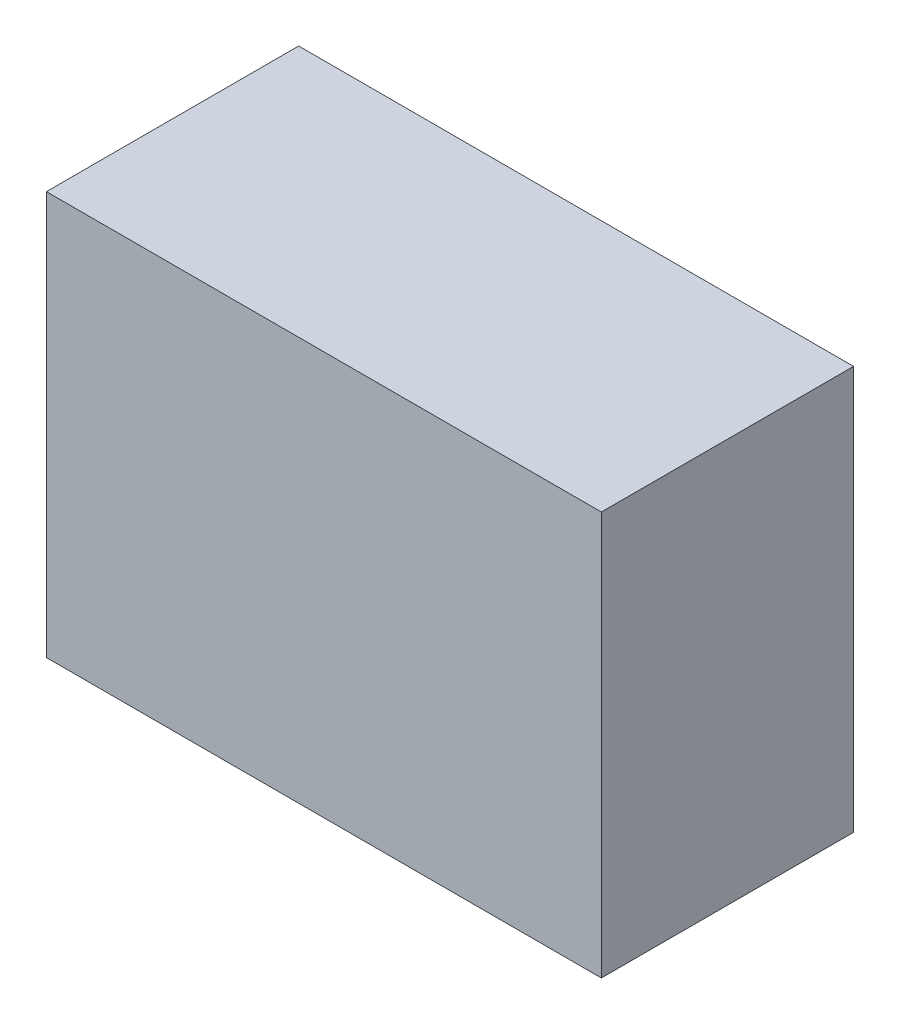
ISO-10303-21;
HEADER;
FILE_DESCRIPTION(('STEP AP214'),'2;1');
FILE_NAME('part.step','',(''),(''),'','','');
FILE_SCHEMA(('AUTOMOTIVE_DESIGN { 1 0 10303 214 1 1 1 1 }'));
ENDSEC;
DATA;
#1=APPLICATION_CONTEXT('core data for automotive mechanical design processes');
#2=APPLICATION_PROTOCOL_DEFINITION('international standard','automotive_design',2000,#1);
#3=PRODUCT_CONTEXT('',#1,'mechanical');
#4=PRODUCT('Part','Part','',(#3));
#5=PRODUCT_RELATED_PRODUCT_CATEGORY('part','',(#4));
#6=PRODUCT_DEFINITION_FORMATION('','',#4);
#7=PRODUCT_DEFINITION_CONTEXT('part definition',#1,'design');
#8=PRODUCT_DEFINITION('design','',#6,#7);
#9=PRODUCT_DEFINITION_SHAPE('','',#8);
#10=(LENGTH_UNIT() NAMED_UNIT(*) SI_UNIT(.MILLI.,.METRE.));
#11=(NAMED_UNIT(*) PLANE_ANGLE_UNIT() SI_UNIT($,.RADIAN.));
#12=(NAMED_UNIT(*) SI_UNIT($,.STERADIAN.) SOLID_ANGLE_UNIT());
#13=UNCERTAINTY_MEASURE_WITH_UNIT(LENGTH_MEASURE(1.E-05),#10,'distance_accuracy_value','');
#14=(GEOMETRIC_REPRESENTATION_CONTEXT(3) GLOBAL_UNCERTAINTY_ASSIGNED_CONTEXT((#13)) GLOBAL_UNIT_ASSIGNED_CONTEXT((#10,
#11,#12)) REPRESENTATION_CONTEXT('',''));
#15=CARTESIAN_POINT('',(0.,0.,0.));
#16=DIRECTION('',(0.,0.,1.));
#17=DIRECTION('',(1.,0.,0.));
#18=AXIS2_PLACEMENT_3D('',#15,#16,#17);
#19=CARTESIAN_POINT('',(0.5499989,-0.3999992,0.));
#20=DIRECTION('',(-1.,0.,0.));
#21=DIRECTION('',(0.,0.,1.));
#22=AXIS2_PLACEMENT_3D('',#19,#20,#21);
#23=PLANE('',#22);
#24=DIRECTION('',(0.,1.,0.));
#25=VECTOR('',#24,1.);
#26=CARTESIAN_POINT('',(0.5499989,-0.3999992,0.));
#27=LINE('',#26,#25);
#28=CARTESIAN_POINT('',(0.5499989,-0.3999992,0.));
#29=VERTEX_POINT('',#28);
#30=CARTESIAN_POINT('',(0.5499989,0.3999992,0.));
#31=VERTEX_POINT('',#30);
#32=EDGE_CURVE('E11',#29,#31,#27,.T.);
#33=ORIENTED_EDGE('',*,*,#32,.T.);
#34=DIRECTION('',(0.,0.,1.));
#35=VECTOR('',#34,1.);
#36=CARTESIAN_POINT('',(0.5499989,0.3999992,0.));
#37=LINE('',#36,#35);
#38=CARTESIAN_POINT('',(0.5499989,0.3999992,0.50000154));
#39=VERTEX_POINT('',#38);
#40=EDGE_CURVE('E27',#31,#39,#37,.T.);
#41=ORIENTED_EDGE('',*,*,#40,.T.);
#42=DIRECTION('',(0.,1.,0.));
#43=VECTOR('',#42,1.);
#44=CARTESIAN_POINT('',(0.5499989,-0.3999992,0.50000154));
#45=LINE('',#44,#43);
#46=CARTESIAN_POINT('',(0.5499989,-0.3999992,0.50000154));
#47=VERTEX_POINT('',#46);
#48=EDGE_CURVE('E64',#47,#39,#45,.T.);
#49=ORIENTED_EDGE('',*,*,#48,.F.);
#50=DIRECTION('',(0.,0.,1.));
#51=VECTOR('',#50,1.);
#52=CARTESIAN_POINT('',(0.5499989,-0.3999992,0.));
#53=LINE('',#52,#51);
#54=EDGE_CURVE('E68',#29,#47,#53,.T.);
#55=ORIENTED_EDGE('',*,*,#54,.F.);
#56=EDGE_LOOP('',(#33,#41,#49,#55));
#57=FACE_BOUND('',#56,.T.);
#58=ADVANCED_FACE('F16',(#57),#23,.F.);
#59=CARTESIAN_POINT('',(0.5499989,0.3999992,0.));
#60=DIRECTION('',(0.,-1.,0.));
#61=DIRECTION('',(0.,0.,-1.));
#62=AXIS2_PLACEMENT_3D('',#59,#60,#61);
#63=PLANE('',#62);
#64=DIRECTION('',(-1.,0.,0.));
#65=VECTOR('',#64,1.);
#66=CARTESIAN_POINT('',(0.5499989,0.3999992,0.));
#67=LINE('',#66,#65);
#68=CARTESIAN_POINT('',(-0.5499989,0.3999992,0.));
#69=VERTEX_POINT('',#68);
#70=EDGE_CURVE('E81',#31,#69,#67,.T.);
#71=ORIENTED_EDGE('',*,*,#70,.T.);
#72=DIRECTION('',(0.,0.,1.));
#73=VECTOR('',#72,1.);
#74=CARTESIAN_POINT('',(-0.5499989,0.3999992,0.));
#75=LINE('',#74,#73);
#76=CARTESIAN_POINT('',(-0.5499989,0.3999992,0.50000154));
#77=VERTEX_POINT('',#76);
#78=EDGE_CURVE('E97',#69,#77,#75,.T.);
#79=ORIENTED_EDGE('',*,*,#78,.T.);
#80=DIRECTION('',(-1.,0.,0.));
#81=VECTOR('',#80,1.);
#82=CARTESIAN_POINT('',(0.5499989,0.3999992,0.50000154));
#83=LINE('',#82,#81);
#84=EDGE_CURVE('E98',#39,#77,#83,.T.);
#85=ORIENTED_EDGE('',*,*,#84,.F.);
#86=ORIENTED_EDGE('',*,*,#40,.F.);
#87=EDGE_LOOP('',(#71,#79,#85,#86));
#88=FACE_BOUND('',#87,.T.);
#89=ADVANCED_FACE('F115',(#88),#63,.F.);
#90=CARTESIAN_POINT('',(-0.5499989,0.3999992,0.));
#91=DIRECTION('',(1.,0.,0.));
#92=DIRECTION('',(0.,1.,0.));
#93=AXIS2_PLACEMENT_3D('',#90,#91,#92);
#94=PLANE('',#93);
#95=DIRECTION('',(0.,-1.,0.));
#96=VECTOR('',#95,1.);
#97=CARTESIAN_POINT('',(-0.5499989,0.3999992,0.));
#98=LINE('',#97,#96);
#99=CARTESIAN_POINT('',(-0.5499989,-0.3999992,0.));
#100=VERTEX_POINT('',#99);
#101=EDGE_CURVE('E92',#69,#100,#98,.T.);
#102=ORIENTED_EDGE('',*,*,#101,.T.);
#103=DIRECTION('',(0.,0.,1.));
#104=VECTOR('',#103,1.);
#105=CARTESIAN_POINT('',(-0.5499989,-0.3999992,0.));
#106=LINE('',#105,#104);
#107=CARTESIAN_POINT('',(-0.5499989,-0.3999992,0.50000154));
#108=VERTEX_POINT('',#107);
#109=EDGE_CURVE('E85',#100,#108,#106,.T.);
#110=ORIENTED_EDGE('',*,*,#109,.T.);
#111=DIRECTION('',(0.,-1.,0.));
#112=VECTOR('',#111,1.);
#113=CARTESIAN_POINT('',(-0.5499989,0.3999992,0.50000154));
#114=LINE('',#113,#112);
#115=EDGE_CURVE('E100',#77,#108,#114,.T.);
#116=ORIENTED_EDGE('',*,*,#115,.F.);
#117=ORIENTED_EDGE('',*,*,#78,.F.);
#118=EDGE_LOOP('',(#102,#110,#116,#117));
#119=FACE_BOUND('',#118,.T.);
#120=ADVANCED_FACE('F117',(#119),#94,.F.);
#121=CARTESIAN_POINT('',(-0.5499989,-0.3999992,0.));
#122=DIRECTION('',(0.,1.,0.));
#123=DIRECTION('',(1.,0.,0.));
#124=AXIS2_PLACEMENT_3D('',#121,#122,#123);
#125=PLANE('',#124);
#126=DIRECTION('',(1.,0.,0.));
#127=VECTOR('',#126,1.);
#128=CARTESIAN_POINT('',(-0.5499989,-0.3999992,0.));
#129=LINE('',#128,#127);
#130=EDGE_CURVE('E76',#100,#29,#129,.T.);
#131=ORIENTED_EDGE('',*,*,#130,.T.);
#132=ORIENTED_EDGE('',*,*,#54,.T.);
#133=DIRECTION('',(1.,0.,0.));
#134=VECTOR('',#133,1.);
#135=CARTESIAN_POINT('',(-0.5499989,-0.3999992,0.50000154));
#136=LINE('',#135,#134);
#137=EDGE_CURVE('E20',#108,#47,#136,.T.);
#138=ORIENTED_EDGE('',*,*,#137,.F.);
#139=ORIENTED_EDGE('',*,*,#109,.F.);
#140=EDGE_LOOP('',(#131,#132,#138,#139));
#141=FACE_BOUND('',#140,.T.);
#142=ADVANCED_FACE('F83',(#141),#125,.F.);
#143=CARTESIAN_POINT('',(0.5499989,-0.3999992,0.));
#144=DIRECTION('',(0.,0.,-1.));
#145=DIRECTION('',(0.,-1.,0.));
#146=AXIS2_PLACEMENT_3D('',#143,#144,#145);
#147=PLANE('',#146);
#148=ORIENTED_EDGE('',*,*,#130,.F.);
#149=ORIENTED_EDGE('',*,*,#101,.F.);
#150=ORIENTED_EDGE('',*,*,#70,.F.);
#151=ORIENTED_EDGE('',*,*,#32,.F.);
#152=EDGE_LOOP('',(#148,#149,#150,#151));
#153=FACE_BOUND('',#152,.T.);
#154=ADVANCED_FACE('F18',(#153),#147,.T.);
#155=CARTESIAN_POINT('',(0.5499989,-0.3999992,0.50000154));
#156=DIRECTION('',(0.,0.,-1.));
#157=DIRECTION('',(0.,-1.,0.));
#158=AXIS2_PLACEMENT_3D('',#155,#156,#157);
#159=PLANE('',#158);
#160=ORIENTED_EDGE('',*,*,#48,.T.);
#161=ORIENTED_EDGE('',*,*,#84,.T.);
#162=ORIENTED_EDGE('',*,*,#115,.T.);
#163=ORIENTED_EDGE('',*,*,#137,.T.);
#164=EDGE_LOOP('',(#160,#161,#162,#163));
#165=FACE_BOUND('',#164,.T.);
#166=ADVANCED_FACE('F119',(#165),#159,.F.);
#167=CLOSED_SHELL('',(#58,#89,#120,#142,#154,#166));
#168=MANIFOLD_SOLID_BREP('B1',#167);
#169=ADVANCED_BREP_SHAPE_REPRESENTATION('',(#18,#168),#14);
#170=SHAPE_DEFINITION_REPRESENTATION(#9,#169);
ENDSEC;
END-ISO-10303-21;
